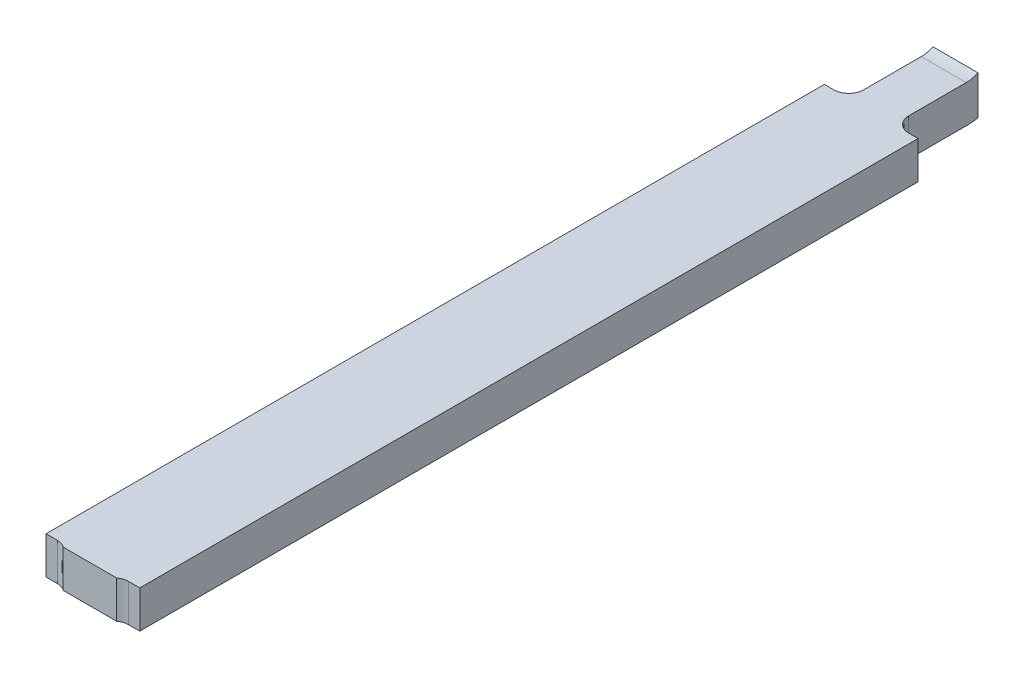
ISO-10303-21;
HEADER;
FILE_DESCRIPTION(('STEP AP214'),'2;1');
FILE_NAME('part.step','',(''),(''),'','','');
FILE_SCHEMA(('AUTOMOTIVE_DESIGN { 1 0 10303 214 1 1 1 1 }'));
ENDSEC;
DATA;
#1=APPLICATION_CONTEXT('core data for automotive mechanical design processes');
#2=APPLICATION_PROTOCOL_DEFINITION('international standard','automotive_design',2000,#1);
#3=PRODUCT_CONTEXT('',#1,'mechanical');
#4=PRODUCT('Part','Part','',(#3));
#5=PRODUCT_RELATED_PRODUCT_CATEGORY('part','',(#4));
#6=PRODUCT_DEFINITION_FORMATION('','',#4);
#7=PRODUCT_DEFINITION_CONTEXT('part definition',#1,'design');
#8=PRODUCT_DEFINITION('design','',#6,#7);
#9=PRODUCT_DEFINITION_SHAPE('','',#8);
#10=(LENGTH_UNIT() NAMED_UNIT(*) SI_UNIT(.MILLI.,.METRE.));
#11=(NAMED_UNIT(*) PLANE_ANGLE_UNIT() SI_UNIT($,.RADIAN.));
#12=(NAMED_UNIT(*) SI_UNIT($,.STERADIAN.) SOLID_ANGLE_UNIT());
#13=UNCERTAINTY_MEASURE_WITH_UNIT(LENGTH_MEASURE(1.E-05),#10,'distance_accuracy_value','');
#14=(GEOMETRIC_REPRESENTATION_CONTEXT(3) GLOBAL_UNCERTAINTY_ASSIGNED_CONTEXT((#13)) GLOBAL_UNIT_ASSIGNED_CONTEXT((#10,
#11,#12)) REPRESENTATION_CONTEXT('',''));
#15=CARTESIAN_POINT('',(0.,0.,0.));
#16=DIRECTION('',(0.,0.,1.));
#17=DIRECTION('',(1.,0.,0.));
#18=AXIS2_PLACEMENT_3D('',#15,#16,#17);
#19=CARTESIAN_POINT('',(-4.,-0.3652289464185,-7.500488855463));
#20=DIRECTION('',(0.,0.,1.));
#21=DIRECTION('',(1.,0.,0.));
#22=AXIS2_PLACEMENT_3D('',#19,#20,#21);
#23=PLANE('',#22);
#24=DIRECTION('',(0.,1.,0.));
#25=VECTOR('',#24,1.);
#26=CARTESIAN_POINT('',(-3.88,-0.3694122088881,-7.500488855463));
#27=LINE('',#26,#25);
#28=CARTESIAN_POINT('',(-3.88,-0.469296338681694,-7.50048885546298));
#29=VERTEX_POINT('',#28);
#30=CARTESIAN_POINT('',(-3.88,-0.261161554155171,-7.50048885546301));
#31=VERTEX_POINT('',#30);
#32=EDGE_CURVE('E150',#29,#31,#27,.T.);
#33=ORIENTED_EDGE('',*,*,#32,.F.);
#34=DIRECTION('',(-1.,0.,0.));
#35=VECTOR('',#34,1.);
#36=CARTESIAN_POINT('',(-3.874272716281,-0.469296338681697,-7.50048885546296));
#37=LINE('',#36,#35);
#38=CARTESIAN_POINT('',(-4.12,-0.469296338681694,-7.50048885546298));
#39=VERTEX_POINT('',#38);
#40=EDGE_CURVE('E139',#39,#29,#37,.F.);
#41=ORIENTED_EDGE('',*,*,#40,.F.);
#42=DIRECTION('',(0.,1.,0.));
#43=VECTOR('',#42,1.);
#44=CARTESIAN_POINT('',(-4.12,-0.3694122088881,-7.500488855463));
#45=LINE('',#44,#43);
#46=CARTESIAN_POINT('',(-4.12,-0.261161554155171,-7.50048885546301));
#47=VERTEX_POINT('',#46);
#48=EDGE_CURVE('E535',#39,#47,#45,.T.);
#49=ORIENTED_EDGE('',*,*,#48,.T.);
#50=DIRECTION('',(1.,0.,0.));
#51=VECTOR('',#50,1.);
#52=CARTESIAN_POINT('',(-4.125727283719,-0.261161554155164,-7.50048885546303));
#53=LINE('',#52,#51);
#54=EDGE_CURVE('E147',#47,#31,#53,.T.);
#55=ORIENTED_EDGE('',*,*,#54,.T.);
#56=EDGE_LOOP('',(#33,#41,#49,#55));
#57=FACE_BOUND('',#56,.T.);
#58=ADVANCED_FACE('F17',(#57),#23,.F.);
#59=CARTESIAN_POINT('',(-3.874272716281,-0.125,-7.43756007691));
#60=DIRECTION('',(-1.,0.,0.));
#61=DIRECTION('',(0.,0.,1.));
#62=AXIS2_PLACEMENT_3D('',#59,#60,#61);
#63=CYLINDRICAL_SURFACE('',#62,0.3499999999997);
#64=CARTESIAN_POINT('',(-4.12,-0.125,-7.43756007691));
#65=DIRECTION('',(-1.,0.,0.));
#66=DIRECTION('',(0.,0.,1.));
#67=AXIS2_PLACEMENT_3D('',#64,#65,#66);
#68=CIRCLE('',#67,0.3499999999997);
#69=CARTESIAN_POINT('',(-4.12,-0.475,-7.43756007691));
#70=VERTEX_POINT('',#69);
#71=EDGE_CURVE('E250',#70,#39,#68,.F.);
#72=ORIENTED_EDGE('',*,*,#71,.T.);
#73=ORIENTED_EDGE('',*,*,#40,.T.);
#74=CARTESIAN_POINT('',(-3.88,-0.125,-7.43756007691));
#75=DIRECTION('',(-1.,0.,0.));
#76=DIRECTION('',(0.,0.,1.));
#77=AXIS2_PLACEMENT_3D('',#74,#75,#76);
#78=CIRCLE('',#77,0.3499999999997);
#79=CARTESIAN_POINT('',(-3.88,-0.475,-7.43756007691));
#80=VERTEX_POINT('',#79);
#81=EDGE_CURVE('E274',#80,#29,#78,.F.);
#82=ORIENTED_EDGE('',*,*,#81,.F.);
#83=DIRECTION('',(1.,0.,0.));
#84=VECTOR('',#83,1.);
#85=CARTESIAN_POINT('',(-4.,-0.475,-7.43756007691));
#86=LINE('',#85,#84);
#87=EDGE_CURVE('E138',#80,#70,#86,.F.);
#88=ORIENTED_EDGE('',*,*,#87,.T.);
#89=EDGE_LOOP('',(#72,#73,#82,#88));
#90=FACE_BOUND('',#89,.T.);
#91=ADVANCED_FACE('F255',(#90),#63,.T.);
#92=CARTESIAN_POINT('',(-4.,-0.475,-5.160844573418));
#93=DIRECTION('',(0.,1.,0.));
#94=DIRECTION('',(0.,0.,1.));
#95=AXIS2_PLACEMENT_3D('',#92,#93,#94);
#96=PLANE('',#95);
#97=DIRECTION('',(1.,0.,0.));
#98=VECTOR('',#97,1.);
#99=CARTESIAN_POINT('',(-4.,-0.475,-2.9));
#100=LINE('',#99,#98);
#101=CARTESIAN_POINT('',(-4.25,-0.475,-2.9));
#102=VERTEX_POINT('',#101);
#103=CARTESIAN_POINT('',(-4.19,-0.475,-2.89999999999976));
#104=VERTEX_POINT('',#103);
#105=EDGE_CURVE('E118',#102,#104,#100,.T.);
#106=ORIENTED_EDGE('',*,*,#105,.F.);
#107=DIRECTION('',(0.,0.,-1.));
#108=VECTOR('',#107,1.);
#109=CARTESIAN_POINT('',(-4.25,-0.475,-4.975579331992));
#110=LINE('',#109,#108);
#111=CARTESIAN_POINT('',(-4.25,-0.475,-7.051158663985));
#112=VERTEX_POINT('',#111);
#113=EDGE_CURVE('E213',#102,#112,#110,.T.);
#114=ORIENTED_EDGE('',*,*,#113,.T.);
#115=DIRECTION('',(1.,0.,0.));
#116=VECTOR('',#115,1.);
#117=CARTESIAN_POINT('',(-4.225,-0.475,-7.051158663985));
#118=LINE('',#117,#116);
#119=CARTESIAN_POINT('',(-4.2,-0.475,-7.05115866398505));
#120=VERTEX_POINT('',#119);
#121=EDGE_CURVE('E218',#112,#120,#118,.T.);
#122=ORIENTED_EDGE('',*,*,#121,.T.);
#123=CARTESIAN_POINT('',(-4.11999999999968,-0.475,-7.131158663985));
#124=CARTESIAN_POINT('',(-4.12000887559487,-0.475,-7.12663228539965));
#125=CARTESIAN_POINT('',(-4.12039503047314,-0.475,-7.12211245444065));
#126=CARTESIAN_POINT('',(-4.12191562674134,-0.475,-7.11320506981295));
#127=CARTESIAN_POINT('',(-4.12304939310094,-0.475,-7.10881740054698));
#128=CARTESIAN_POINT('',(-4.12755618553401,-0.475,-7.09604021502533));
#129=CARTESIAN_POINT('',(-4.1320348186504,-0.475,-7.08801257629078));
#130=CARTESIAN_POINT('',(-4.14334118864265,-0.475,-7.07397145931293));
#131=CARTESIAN_POINT('',(-4.15014907486861,-0.475,-7.06794178198468));
#132=CARTESIAN_POINT('',(-4.16542981568031,-0.475,-7.05845747919416));
#133=CARTESIAN_POINT('',(-4.17391091624519,-0.475,-7.05501603051908));
#134=CARTESIAN_POINT('',(-4.18838450867067,-0.475,-7.05178938735803));
#135=CARTESIAN_POINT('',(-4.19419660039155,-0.475,-7.05114165155808));
#136=CARTESIAN_POINT('',(-4.2,-0.475,-7.05115866398511));
#137=B_SPLINE_CURVE_WITH_KNOTS('',3,(#123,#124,#125,#126,#127,#128,#129,#130,#131,#132,#133,
#134,#135,#136),.UNSPECIFIED.,.F.,.F.,(4,2,2,2,2,2,4),(0.,0.0135512792184595,0.0270903394942052,
0.0541002294468739,0.0808854407468732,0.107806110463938,0.125207976056708),.UNSPECIFIED.);
#138=CARTESIAN_POINT('',(-4.11999999999984,-0.475,-7.131158663985));
#139=VERTEX_POINT('',#138);
#140=EDGE_CURVE('E239',#139,#120,#137,.T.);
#141=ORIENTED_EDGE('',*,*,#140,.F.);
#142=DIRECTION('',(0.,0.,-1.));
#143=VECTOR('',#142,1.);
#144=CARTESIAN_POINT('',(-4.12,-0.475,-7.317732357319));
#145=LINE('',#144,#143);
#146=EDGE_CURVE('E537',#139,#70,#145,.T.);
#147=ORIENTED_EDGE('',*,*,#146,.T.);
#148=ORIENTED_EDGE('',*,*,#87,.F.);
#149=DIRECTION('',(0.,0.,-1.));
#150=VECTOR('',#149,1.);
#151=CARTESIAN_POINT('',(-3.88,-0.475,-7.317732357319));
#152=LINE('',#151,#150);
#153=CARTESIAN_POINT('',(-3.87999999999995,-0.475,-7.131158663985));
#154=VERTEX_POINT('',#153);
#155=EDGE_CURVE('E533',#154,#80,#152,.T.);
#156=ORIENTED_EDGE('',*,*,#155,.F.);
#157=CARTESIAN_POINT('',(-3.8,-0.475,-7.05115866398468));
#158=CARTESIAN_POINT('',(-3.80452637858535,-0.475,-7.05116753957987));
#159=CARTESIAN_POINT('',(-3.80904620954435,-0.475,-7.05155369445814));
#160=CARTESIAN_POINT('',(-3.81795359417204,-0.475,-7.05307429072634));
#161=CARTESIAN_POINT('',(-3.82234126343802,-0.475,-7.05420805708594));
#162=CARTESIAN_POINT('',(-3.83511844895965,-0.475,-7.058714849519));
#163=CARTESIAN_POINT('',(-3.8431460876942,-0.475,-7.06319348263539));
#164=CARTESIAN_POINT('',(-3.85718720467206,-0.475,-7.07449985262764));
#165=CARTESIAN_POINT('',(-3.86321688200032,-0.475,-7.0813077388536));
#166=CARTESIAN_POINT('',(-3.87270118479084,-0.475,-7.09658847966531));
#167=CARTESIAN_POINT('',(-3.87614263346592,-0.475,-7.10506958023019));
#168=CARTESIAN_POINT('',(-3.87936927662697,-0.475,-7.11954317265567));
#169=CARTESIAN_POINT('',(-3.88001701242693,-0.475,-7.12535526437655));
#170=CARTESIAN_POINT('',(-3.87999999999989,-0.475,-7.131158663985));
#171=B_SPLINE_CURVE_WITH_KNOTS('',3,(#157,#158,#159,#160,#161,#162,#163,#164,#165,#166,#167,
#168,#169,#170),.UNSPECIFIED.,.F.,.F.,(4,2,2,2,2,2,4),(0.,0.0135512792184538,0.0270903394941928,
0.0541002294468487,0.0808854407468798,0.107806110463935,0.125207976056707),.UNSPECIFIED.);
#172=CARTESIAN_POINT('',(-3.8,-0.475,-7.05115866398484));
#173=VERTEX_POINT('',#172);
#174=EDGE_CURVE('E266',#173,#154,#171,.T.);
#175=ORIENTED_EDGE('',*,*,#174,.F.);
#176=DIRECTION('',(1.,0.,0.));
#177=VECTOR('',#176,1.);
#178=CARTESIAN_POINT('',(-3.775,-0.475,-7.051158663985));
#179=LINE('',#178,#177);
#180=CARTESIAN_POINT('',(-3.75,-0.475,-7.051158663985));
#181=VERTEX_POINT('',#180);
#182=EDGE_CURVE('E151',#173,#181,#179,.T.);
#183=ORIENTED_EDGE('',*,*,#182,.T.);
#184=DIRECTION('',(0.,0.,-1.));
#185=VECTOR('',#184,1.);
#186=CARTESIAN_POINT('',(-3.75,-0.475,-4.975579331992));
#187=LINE('',#186,#185);
#188=CARTESIAN_POINT('',(-3.75,-0.475,-2.9));
#189=VERTEX_POINT('',#188);
#190=EDGE_CURVE('E155',#189,#181,#187,.T.);
#191=ORIENTED_EDGE('',*,*,#190,.F.);
#192=DIRECTION('',(1.,0.,0.));
#193=VECTOR('',#192,1.);
#194=CARTESIAN_POINT('',(-3.78,-0.475,-2.9));
#195=LINE('',#194,#193);
#196=CARTESIAN_POINT('',(-3.81,-0.475,-2.89999999999989));
#197=VERTEX_POINT('',#196);
#198=EDGE_CURVE('E163',#197,#189,#195,.T.);
#199=ORIENTED_EDGE('',*,*,#198,.F.);
#200=CARTESIAN_POINT('',(-3.85782455242115,-0.475,-2.8841290699251));
#201=CARTESIAN_POINT('',(-3.85377977929529,-0.475,-2.88715347788678));
#202=CARTESIAN_POINT('',(-3.8494455741793,-0.475,-2.88978498732686));
#203=CARTESIAN_POINT('',(-3.84086630502368,-0.475,-2.8939430866676));
#204=CARTESIAN_POINT('',(-3.83666481589101,-0.475,-2.89555994023161));
#205=CARTESIAN_POINT('',(-3.828051190578,-0.475,-2.89806057790455));
#206=CARTESIAN_POINT('',(-3.82363918895055,-0.475,-2.898944823807));
#207=CARTESIAN_POINT('',(-3.81613636516881,-0.475,-2.89981357444961));
#208=CARTESIAN_POINT('',(-3.81306715843202,-0.475,-2.89999375978714));
#209=CARTESIAN_POINT('',(-3.81,-0.475,-2.89999999999978));
#210=B_SPLINE_CURVE_WITH_KNOTS('',3,(#200,#201,#202,#203,#204,#205,#206,#207,#208,#209),
.UNSPECIFIED.,.F.,.F.,(4,2,2,2,4),(0.,0.0151223248428406,0.0285648972663139,0.0419989898086887,
0.0512012871013954),.UNSPECIFIED.);
#211=CARTESIAN_POINT('',(-3.85782455242108,-0.475,-2.88412906992505));
#212=VERTEX_POINT('',#211);
#213=EDGE_CURVE('E125',#212,#197,#210,.T.);
#214=ORIENTED_EDGE('',*,*,#213,.F.);
#215=DIRECTION('',(1.,0.,0.));
#216=VECTOR('',#215,1.);
#217=CARTESIAN_POINT('',(-4.,-0.475,-2.884129069925));
#218=LINE('',#217,#216);
#219=CARTESIAN_POINT('',(-4.14217543362795,-0.475,-2.88412906992502));
#220=VERTEX_POINT('',#219);
#221=EDGE_CURVE('E129',#220,#212,#218,.T.);
#222=ORIENTED_EDGE('',*,*,#221,.F.);
#223=CARTESIAN_POINT('',(-4.19,-0.475,-2.89999999999952));
#224=CARTESIAN_POINT('',(-4.18496730361836,-0.475,-2.90001482409384));
#225=CARTESIAN_POINT('',(-4.17991815783308,-0.475,-2.89952557596737));
#226=CARTESIAN_POINT('',(-4.16614771604895,-0.475,-2.89686256447201));
#227=CARTESIAN_POINT('',(-4.15760052391878,-0.475,-2.89367998586962));
#228=CARTESIAN_POINT('',(-4.14719213429875,-0.475,-2.88765952253235));
#229=CARTESIAN_POINT('',(-4.14462559871614,-0.475,-2.88596721904186));
#230=CARTESIAN_POINT('',(-4.1421754336279,-0.475,-2.88412906992503));
#231=B_SPLINE_CURVE_WITH_KNOTS('',3,(#223,#224,#225,#226,#227,#228,#229,#230),.UNSPECIFIED.,.F.,
.F.,(4,2,2,4),(0.,0.0151178951010511,0.0419060489798834,0.05110634020207),.UNSPECIFIED.);
#232=EDGE_CURVE('E20',#104,#220,#231,.T.);
#233=ORIENTED_EDGE('',*,*,#232,.F.);
#234=EDGE_LOOP('',(#106,#114,#122,#141,#147,#148,#156,#175,#183,#191,#199,#214,#222,#233));
#235=FACE_BOUND('',#234,.T.);
#236=ADVANCED_FACE('F135',(#235),#96,.F.);
#237=CARTESIAN_POINT('',(-3.807132391521,-0.269272716281,-2.899957930186));
#238=CARTESIAN_POINT('',(-3.808087324483,-0.269272716281,-2.899988554812));
#239=CARTESIAN_POINT('',(-3.814268512342,-0.269272716281,-2.900079343105));
#240=CARTESIAN_POINT('',(-3.825708586311,-0.269272716281,-2.898963559635));
#241=CARTESIAN_POINT('',(-3.840809082916,-0.269272716281,-2.894390814224));
#242=CARTESIAN_POINT('',(-3.8513126737,-0.269272716281,-2.888776760997));
#243=CARTESIAN_POINT('',(-3.858278976833,-0.269272716281,-2.883851645707));
#244=CARTESIAN_POINT('',(-3.860847948139,-0.269272716281,-2.881786274905));
#245=CARTESIAN_POINT('',(-3.862294521887,-0.269272716281,-2.880535760884));
#246=(BOUNDED_CURVE() B_SPLINE_CURVE(3,(#237,#238,#239,#240,#241,#242,#243,#244,#245),
.UNSPECIFIED.,.F.,.F.) B_SPLINE_CURVE_WITH_KNOTS((4,1,1,1,1,1,4),(0.,0.0480076126077,
0.3103664664067,0.5726487803877,0.8349383013297,0.9041878403074,1.),
.UNSPECIFIED.) CURVE() GEOMETRIC_REPRESENTATION_ITEM() RATIONAL_B_SPLINE_CURVE((1.,1.,1.,1.,1.,
1.,1.,1.,1.)) REPRESENTATION_ITEM(''));
#247=DIRECTION('',(0.,-1.,0.));
#248=VECTOR('',#247,1.);
#249=SURFACE_OF_LINEAR_EXTRUSION('',#246,#248);
#250=CARTESIAN_POINT('',(-3.85782455535254,-0.275,-2.88412906773656));
#251=CARTESIAN_POINT('',(-3.85377978236567,-0.275,-2.88715347588347));
#252=CARTESIAN_POINT('',(-3.84944557737024,-0.275,-2.88978498552233));
#253=CARTESIAN_POINT('',(-3.84086630840598,-0.275,-2.89394308525624));
#254=CARTESIAN_POINT('',(-3.83666481934832,-0.275,-2.89555993901277));
#255=CARTESIAN_POINT('',(-3.82805119415026,-0.275,-2.89806057708111));
#256=CARTESIAN_POINT('',(-3.82363919256267,-0.275,-2.89894482318606));
#257=CARTESIAN_POINT('',(-3.81613636760673,-0.275,-2.89981357430863));
#258=CARTESIAN_POINT('',(-3.81306715965084,-0.275,-2.89999375978684));
#259=CARTESIAN_POINT('',(-3.81,-0.275,-2.89999999999978));
#260=B_SPLINE_CURVE_WITH_KNOTS('',3,(#250,#251,#252,#253,#254,#255,#256,#257,#258,#259),
.UNSPECIFIED.,.F.,.F.,(4,2,2,2,4),(0.,0.0151223248426714,0.0285648972632457,0.0419989898096649,
0.0512012907536535),.UNSPECIFIED.);
#261=CARTESIAN_POINT('',(-3.85782455388677,-0.275,-2.88412906883078));
#262=VERTEX_POINT('',#261);
#263=CARTESIAN_POINT('',(-3.81,-0.275,-2.9));
#264=VERTEX_POINT('',#263);
#265=EDGE_CURVE('E132',#262,#264,#260,.T.);
#266=ORIENTED_EDGE('',*,*,#265,.F.);
#267=DIRECTION('',(0.,1.,0.));
#268=VECTOR('',#267,1.);
#269=CARTESIAN_POINT('',(-3.857824552421,-0.375,-2.884129069925));
#270=LINE('',#269,#268);
#271=EDGE_CURVE('E133',#212,#262,#270,.T.);
#272=ORIENTED_EDGE('',*,*,#271,.F.);
#273=ORIENTED_EDGE('',*,*,#213,.T.);
#274=DIRECTION('',(0.,1.,0.));
#275=VECTOR('',#274,1.);
#276=CARTESIAN_POINT('',(-3.81,-0.375,-2.9));
#277=LINE('',#276,#275);
#278=EDGE_CURVE('E166',#264,#197,#277,.F.);
#279=ORIENTED_EDGE('',*,*,#278,.F.);
#280=EDGE_LOOP('',(#266,#272,#273,#279));
#281=FACE_BOUND('',#280,.T.);
#282=ADVANCED_FACE('F254',(#281),#249,.T.);
#283=CARTESIAN_POINT('',(-3.78,-0.375,-2.9));
#284=DIRECTION('',(0.,0.,1.));
#285=DIRECTION('',(1.,0.,0.));
#286=AXIS2_PLACEMENT_3D('',#283,#284,#285);
#287=PLANE('',#286);
#288=DIRECTION('',(0.,1.,0.));
#289=VECTOR('',#288,1.);
#290=CARTESIAN_POINT('',(-3.75,-0.375,-2.9));
#291=LINE('',#290,#289);
#292=CARTESIAN_POINT('',(-3.75,-0.275,-2.9));
#293=VERTEX_POINT('',#292);
#294=EDGE_CURVE('E160',#293,#189,#291,.F.);
#295=ORIENTED_EDGE('',*,*,#294,.F.);
#296=DIRECTION('',(1.,0.,0.));
#297=VECTOR('',#296,1.);
#298=CARTESIAN_POINT('',(-4.,-0.275,-2.9));
#299=LINE('',#298,#297);
#300=EDGE_CURVE('E306',#264,#293,#299,.T.);
#301=ORIENTED_EDGE('',*,*,#300,.F.);
#302=ORIENTED_EDGE('',*,*,#278,.T.);
#303=ORIENTED_EDGE('',*,*,#198,.T.);
#304=EDGE_LOOP('',(#295,#301,#302,#303));
#305=FACE_BOUND('',#304,.T.);
#306=ADVANCED_FACE('F368',(#305),#287,.T.);
#307=CARTESIAN_POINT('',(-3.75,-0.375,-4.975579331992));
#308=DIRECTION('',(1.,0.,0.));
#309=DIRECTION('',(0.,0.,-1.));
#310=AXIS2_PLACEMENT_3D('',#307,#308,#309);
#311=PLANE('',#310);
#312=DIRECTION('',(0.,1.,0.));
#313=VECTOR('',#312,1.);
#314=CARTESIAN_POINT('',(-3.75,-0.375,-7.051158663985));
#315=LINE('',#314,#313);
#316=CARTESIAN_POINT('',(-3.75,-0.275,-7.051158663985));
#317=VERTEX_POINT('',#316);
#318=EDGE_CURVE('E154',#181,#317,#315,.T.);
#319=ORIENTED_EDGE('',*,*,#318,.T.);
#320=DIRECTION('',(0.,0.,1.));
#321=VECTOR('',#320,1.);
#322=CARTESIAN_POINT('',(-3.75,-0.275,-5.160844573418));
#323=LINE('',#322,#321);
#324=EDGE_CURVE('E302',#293,#317,#323,.F.);
#325=ORIENTED_EDGE('',*,*,#324,.F.);
#326=ORIENTED_EDGE('',*,*,#294,.T.);
#327=ORIENTED_EDGE('',*,*,#190,.T.);
#328=EDGE_LOOP('',(#319,#325,#326,#327));
#329=FACE_BOUND('',#328,.T.);
#330=ADVANCED_FACE('F373',(#329),#311,.T.);
#331=CARTESIAN_POINT('',(-3.775,-0.375,-7.051158663985));
#332=DIRECTION('',(0.,0.,1.));
#333=DIRECTION('',(1.,0.,0.));
#334=AXIS2_PLACEMENT_3D('',#331,#332,#333);
#335=PLANE('',#334);
#336=ORIENTED_EDGE('',*,*,#182,.F.);
#337=DIRECTION('',(0.,-1.,0.));
#338=VECTOR('',#337,1.);
#339=CARTESIAN_POINT('',(-3.8,-0.269272716281,-7.05115866398468));
#340=LINE('',#339,#338);
#341=CARTESIAN_POINT('',(-3.8,-0.275,-7.05115866398476));
#342=VERTEX_POINT('',#341);
#343=EDGE_CURVE('E273',#342,#173,#340,.T.);
#344=ORIENTED_EDGE('',*,*,#343,.F.);
#345=DIRECTION('',(1.,0.,0.));
#346=VECTOR('',#345,1.);
#347=CARTESIAN_POINT('',(-4.,-0.275,-7.051158663985));
#348=LINE('',#347,#346);
#349=EDGE_CURVE('E305',#317,#342,#348,.F.);
#350=ORIENTED_EDGE('',*,*,#349,.F.);
#351=ORIENTED_EDGE('',*,*,#318,.F.);
#352=EDGE_LOOP('',(#336,#344,#350,#351));
#353=FACE_BOUND('',#352,.T.);
#354=ADVANCED_FACE('F283',(#353),#335,.F.);
#355=CARTESIAN_POINT('',(-3.879957929587,-0.269272716281,-7.134026291144));
#356=CARTESIAN_POINT('',(-3.879988554629,-0.269272716281,-7.133071351971));
#357=CARTESIAN_POINT('',(-3.880079343715,-0.269272716281,-7.126890157897));
#358=CARTESIAN_POINT('',(-3.878963559635,-0.269272716281,-7.115450077674));
#359=CARTESIAN_POINT('',(-3.874390814224,-0.269272716281,-7.100349581069));
#360=CARTESIAN_POINT('',(-3.866951052025,-0.269272716281,-7.086430187272));
#361=CARTESIAN_POINT('',(-3.856931304376,-0.269272716281,-7.074236320435));
#362=CARTESIAN_POINT('',(-3.844737903504,-0.269272716281,-7.064213675467));
#363=CARTESIAN_POINT('',(-3.830816201624,-0.269272716281,-7.056770327068));
#364=CARTESIAN_POINT('',(-3.815712040492,-0.269272716281,-7.05219575577));
#365=CARTESIAN_POINT('',(-3.804270485404,-0.269272716281,-7.051079350384));
#366=CARTESIAN_POINT('',(-3.798089320739,-0.269272716281,-7.051170096432));
#367=CARTESIAN_POINT('',(-3.797135381259,-0.269272716281,-7.0512006723));
#368=(BOUNDED_CURVE() B_SPLINE_CURVE(3,(#355,#356,#357,#358,#359,#360,#361,#362,#363,#364,#365,
#366,#367),.UNSPECIFIED.,.F.,.F.) B_SPLINE_CURVE_WITH_KNOTS((4,1,1,1,1,1,1,1,1,1,4),(0.,
0.02187366901521,0.1414112381412,0.260913933719,0.380419912977,0.4999590271853,0.6195124003892,
0.7390518477007,0.8585895788734,0.9781493142558,1.),
.UNSPECIFIED.) CURVE() GEOMETRIC_REPRESENTATION_ITEM() RATIONAL_B_SPLINE_CURVE((1.,1.,1.,1.,1.,
1.,1.,1.,1.,1.,1.,1.,1.)) REPRESENTATION_ITEM(''));
#369=DIRECTION('',(0.,-1.,0.));
#370=VECTOR('',#369,1.);
#371=SURFACE_OF_LINEAR_EXTRUSION('',#368,#370);
#372=DIRECTION('',(0.,1.,0.));
#373=VECTOR('',#372,1.);
#374=CARTESIAN_POINT('',(-3.88,-0.3694122088881,-7.131158663985));
#375=LINE('',#374,#373);
#376=CARTESIAN_POINT('',(-3.88,-0.275,-7.131158663985));
#377=VERTEX_POINT('',#376);
#378=EDGE_CURVE('E272',#377,#154,#375,.F.);
#379=ORIENTED_EDGE('',*,*,#378,.F.);
#380=CARTESIAN_POINT('',(-3.8,-0.275,-7.05115866398468));
#381=CARTESIAN_POINT('',(-3.80452637858535,-0.275,-7.05116753957987));
#382=CARTESIAN_POINT('',(-3.80904620954435,-0.275,-7.05155369445814));
#383=CARTESIAN_POINT('',(-3.81795359417204,-0.275,-7.05307429072634));
#384=CARTESIAN_POINT('',(-3.82234126343802,-0.275,-7.05420805708594));
#385=CARTESIAN_POINT('',(-3.83511844895965,-0.275,-7.058714849519));
#386=CARTESIAN_POINT('',(-3.8431460876942,-0.275,-7.06319348263539));
#387=CARTESIAN_POINT('',(-3.85718720467206,-0.275,-7.07449985262764));
#388=CARTESIAN_POINT('',(-3.86321688200032,-0.275,-7.0813077388536));
#389=CARTESIAN_POINT('',(-3.87270118479084,-0.275,-7.09658847966531));
#390=CARTESIAN_POINT('',(-3.87614263346592,-0.275,-7.10506958023019));
#391=CARTESIAN_POINT('',(-3.87936927662697,-0.275,-7.11954317265567));
#392=CARTESIAN_POINT('',(-3.88001701242693,-0.275,-7.12535526437655));
#393=CARTESIAN_POINT('',(-3.87999999999989,-0.275,-7.131158663985));
#394=B_SPLINE_CURVE_WITH_KNOTS('',3,(#380,#381,#382,#383,#384,#385,#386,#387,#388,#389,#390,
#391,#392,#393),.UNSPECIFIED.,.F.,.F.,(4,2,2,2,2,2,4),(0.,0.0135512792184538,0.0270903394941928,
0.0541002294468487,0.0808854407468798,0.107806110463935,0.125207976056707),.UNSPECIFIED.);
#395=EDGE_CURVE('E355',#342,#377,#394,.T.);
#396=ORIENTED_EDGE('',*,*,#395,.F.);
#397=ORIENTED_EDGE('',*,*,#343,.T.);
#398=ORIENTED_EDGE('',*,*,#174,.T.);
#399=EDGE_LOOP('',(#379,#396,#397,#398));
#400=FACE_BOUND('',#399,.T.);
#401=ADVANCED_FACE('F276',(#400),#371,.T.);
#402=CARTESIAN_POINT('',(-3.88,-0.3694122088881,-7.317732357319));
#403=DIRECTION('',(1.,0.,0.));
#404=DIRECTION('',(0.,0.,-1.));
#405=AXIS2_PLACEMENT_3D('',#402,#403,#404);
#406=PLANE('',#405);
#407=ORIENTED_EDGE('',*,*,#81,.T.);
#408=ORIENTED_EDGE('',*,*,#32,.T.);
#409=CARTESIAN_POINT('',(-3.88,-0.125,-7.437560076911));
#410=DIRECTION('',(1.,0.,0.));
#411=DIRECTION('',(0.,0.,-1.));
#412=AXIS2_PLACEMENT_3D('',#409,#410,#411);
#413=CIRCLE('',#412,0.15);
#414=CARTESIAN_POINT('',(-3.88,-0.275,-7.437560076911));
#415=VERTEX_POINT('',#414);
#416=EDGE_CURVE('E149',#31,#415,#413,.F.);
#417=ORIENTED_EDGE('',*,*,#416,.T.);
#418=DIRECTION('',(0.,0.,1.));
#419=VECTOR('',#418,1.);
#420=CARTESIAN_POINT('',(-3.88,-0.275,-5.160844573418));
#421=LINE('',#420,#419);
#422=EDGE_CURVE('E348',#377,#415,#421,.F.);
#423=ORIENTED_EDGE('',*,*,#422,.F.);
#424=ORIENTED_EDGE('',*,*,#378,.T.);
#425=ORIENTED_EDGE('',*,*,#155,.T.);
#426=EDGE_LOOP('',(#407,#408,#417,#423,#424,#425));
#427=FACE_BOUND('',#426,.T.);
#428=ADVANCED_FACE('F282',(#427),#406,.T.);
#429=CARTESIAN_POINT('',(-4.125727283719,-0.125,-7.437560076911));
#430=DIRECTION('',(1.,0.,0.));
#431=DIRECTION('',(0.,0.,-1.));
#432=AXIS2_PLACEMENT_3D('',#429,#430,#431);
#433=CYLINDRICAL_SURFACE('',#432,0.15);
#434=DIRECTION('',(1.,0.,0.));
#435=VECTOR('',#434,1.);
#436=CARTESIAN_POINT('',(-4.,-0.275,-7.437560076911));
#437=LINE('',#436,#435);
#438=CARTESIAN_POINT('',(-4.12,-0.275,-7.437560076911));
#439=VERTEX_POINT('',#438);
#440=EDGE_CURVE('E346',#415,#439,#437,.F.);
#441=ORIENTED_EDGE('',*,*,#440,.F.);
#442=ORIENTED_EDGE('',*,*,#416,.F.);
#443=ORIENTED_EDGE('',*,*,#54,.F.);
#444=CARTESIAN_POINT('',(-4.12,-0.125,-7.437560076911));
#445=DIRECTION('',(1.,0.,0.));
#446=DIRECTION('',(0.,0.,-1.));
#447=AXIS2_PLACEMENT_3D('',#444,#445,#446);
#448=CIRCLE('',#447,0.15);
#449=EDGE_CURVE('E536',#47,#439,#448,.F.);
#450=ORIENTED_EDGE('',*,*,#449,.T.);
#451=EDGE_LOOP('',(#441,#442,#443,#450));
#452=FACE_BOUND('',#451,.T.);
#453=ADVANCED_FACE('F443',(#452),#433,.F.);
#454=CARTESIAN_POINT('',(-4.12,-0.3694122088881,-7.317732357319));
#455=DIRECTION('',(1.,0.,0.));
#456=DIRECTION('',(0.,0.,-1.));
#457=AXIS2_PLACEMENT_3D('',#454,#455,#456);
#458=PLANE('',#457);
#459=ORIENTED_EDGE('',*,*,#146,.F.);
#460=DIRECTION('',(0.,-1.,0.));
#461=VECTOR('',#460,1.);
#462=CARTESIAN_POINT('',(-4.11999999999968,-0.269272716281,-7.131158663985));
#463=LINE('',#462,#461);
#464=CARTESIAN_POINT('',(-4.11999999999976,-0.275,-7.131158663985));
#465=VERTEX_POINT('',#464);
#466=EDGE_CURVE('E223',#465,#139,#463,.T.);
#467=ORIENTED_EDGE('',*,*,#466,.F.);
#468=DIRECTION('',(0.,0.,1.));
#469=VECTOR('',#468,1.);
#470=CARTESIAN_POINT('',(-4.12,-0.275,-5.160844573418));
#471=LINE('',#470,#469);
#472=EDGE_CURVE('E345',#439,#465,#471,.T.);
#473=ORIENTED_EDGE('',*,*,#472,.F.);
#474=ORIENTED_EDGE('',*,*,#449,.F.);
#475=ORIENTED_EDGE('',*,*,#48,.F.);
#476=ORIENTED_EDGE('',*,*,#71,.F.);
#477=EDGE_LOOP('',(#459,#467,#473,#474,#475,#476));
#478=FACE_BOUND('',#477,.T.);
#479=ADVANCED_FACE('F234',(#478),#458,.F.);
#480=CARTESIAN_POINT('',(-4.202867627159,-0.269272716281,-7.051200734398));
#481=CARTESIAN_POINT('',(-4.201912687986,-0.269272716281,-7.051170109356));
#482=CARTESIAN_POINT('',(-4.195731493912,-0.269272716281,-7.05107932027));
#483=CARTESIAN_POINT('',(-4.184291413689,-0.269272716281,-7.05219510435));
#484=CARTESIAN_POINT('',(-4.169190917084,-0.269272716281,-7.056767849761));
#485=CARTESIAN_POINT('',(-4.155271523287,-0.269272716281,-7.06420761196));
#486=CARTESIAN_POINT('',(-4.14307765645,-0.269272716281,-7.074227359609));
#487=CARTESIAN_POINT('',(-4.133055011482,-0.269272716281,-7.086420760481));
#488=CARTESIAN_POINT('',(-4.125611663083,-0.269272716281,-7.100342462361));
#489=CARTESIAN_POINT('',(-4.121037091785,-0.269272716281,-7.115446623493));
#490=CARTESIAN_POINT('',(-4.119920686399,-0.269272716281,-7.126888178581));
#491=CARTESIAN_POINT('',(-4.120011432447,-0.269272716281,-7.133069343246));
#492=CARTESIAN_POINT('',(-4.120042008315,-0.269272716281,-7.134023282726));
#493=(BOUNDED_CURVE() B_SPLINE_CURVE(3,(#480,#481,#482,#483,#484,#485,#486,#487,#488,#489,#490,
#491,#492),.UNSPECIFIED.,.F.,.F.) B_SPLINE_CURVE_WITH_KNOTS((4,1,1,1,1,1,1,1,1,1,4),(0.,
0.02187366901522,0.1414112381412,0.260913933719,0.380419912977,0.4999590271853,0.6195124003892,
0.7390518477007,0.8585895788734,0.9781493142558,1.),
.UNSPECIFIED.) CURVE() GEOMETRIC_REPRESENTATION_ITEM() RATIONAL_B_SPLINE_CURVE((1.,1.,1.,1.,1.,
1.,1.,1.,1.,1.,1.,1.,1.)) REPRESENTATION_ITEM(''));
#494=DIRECTION('',(0.,-1.,0.));
#495=VECTOR('',#494,1.);
#496=SURFACE_OF_LINEAR_EXTRUSION('',#493,#495);
#497=DIRECTION('',(0.,1.,0.));
#498=VECTOR('',#497,1.);
#499=CARTESIAN_POINT('',(-4.2,-0.375,-7.051158663985));
#500=LINE('',#499,#498);
#501=CARTESIAN_POINT('',(-4.2,-0.275,-7.051158663985));
#502=VERTEX_POINT('',#501);
#503=EDGE_CURVE('E216',#120,#502,#500,.T.);
#504=ORIENTED_EDGE('',*,*,#503,.T.);
#505=CARTESIAN_POINT('',(-4.11999999999968,-0.275,-7.131158663985));
#506=CARTESIAN_POINT('',(-4.12000887559487,-0.275,-7.12663228539965));
#507=CARTESIAN_POINT('',(-4.12039503047314,-0.275,-7.12211245444065));
#508=CARTESIAN_POINT('',(-4.12191562674134,-0.275,-7.11320506981295));
#509=CARTESIAN_POINT('',(-4.12304939310094,-0.275,-7.10881740054698));
#510=CARTESIAN_POINT('',(-4.12755618553401,-0.275,-7.09604021502533));
#511=CARTESIAN_POINT('',(-4.1320348186504,-0.275,-7.08801257629078));
#512=CARTESIAN_POINT('',(-4.14334118864265,-0.275,-7.07397145931293));
#513=CARTESIAN_POINT('',(-4.15014907486861,-0.275,-7.06794178198468));
#514=CARTESIAN_POINT('',(-4.16542981568031,-0.275,-7.05845747919416));
#515=CARTESIAN_POINT('',(-4.17391091624519,-0.275,-7.05501603051908));
#516=CARTESIAN_POINT('',(-4.18838450867067,-0.275,-7.05178938735803));
#517=CARTESIAN_POINT('',(-4.19419660039155,-0.275,-7.05114165155808));
#518=CARTESIAN_POINT('',(-4.2,-0.275,-7.05115866398511));
#519=B_SPLINE_CURVE_WITH_KNOTS('',3,(#505,#506,#507,#508,#509,#510,#511,#512,#513,#514,#515,
#516,#517,#518),.UNSPECIFIED.,.F.,.F.,(4,2,2,2,2,2,4),(0.,0.0135512792184595,0.0270903394942052,
0.0541002294468739,0.0808854407468732,0.107806110463938,0.125207976056707),.UNSPECIFIED.);
#520=EDGE_CURVE('E175',#465,#502,#519,.T.);
#521=ORIENTED_EDGE('',*,*,#520,.F.);
#522=ORIENTED_EDGE('',*,*,#466,.T.);
#523=ORIENTED_EDGE('',*,*,#140,.T.);
#524=EDGE_LOOP('',(#504,#521,#522,#523));
#525=FACE_BOUND('',#524,.T.);
#526=ADVANCED_FACE('F228',(#525),#496,.T.);
#527=CARTESIAN_POINT('',(-4.225,-0.375,-7.051158663985));
#528=DIRECTION('',(0.,0.,1.));
#529=DIRECTION('',(1.,0.,0.));
#530=AXIS2_PLACEMENT_3D('',#527,#528,#529);
#531=PLANE('',#530);
#532=ORIENTED_EDGE('',*,*,#121,.F.);
#533=DIRECTION('',(0.,1.,0.));
#534=VECTOR('',#533,1.);
#535=CARTESIAN_POINT('',(-4.25,-0.375,-7.051158663985));
#536=LINE('',#535,#534);
#537=CARTESIAN_POINT('',(-4.25,-0.275,-7.051158663985));
#538=VERTEX_POINT('',#537);
#539=EDGE_CURVE('E202',#112,#538,#536,.T.);
#540=ORIENTED_EDGE('',*,*,#539,.T.);
#541=DIRECTION('',(1.,0.,0.));
#542=VECTOR('',#541,1.);
#543=CARTESIAN_POINT('',(-4.,-0.275,-7.051158663985));
#544=LINE('',#543,#542);
#545=EDGE_CURVE('E208',#502,#538,#544,.F.);
#546=ORIENTED_EDGE('',*,*,#545,.F.);
#547=ORIENTED_EDGE('',*,*,#503,.F.);
#548=EDGE_LOOP('',(#532,#540,#546,#547));
#549=FACE_BOUND('',#548,.T.);
#550=ADVANCED_FACE('F233',(#549),#531,.F.);
#551=CARTESIAN_POINT('',(-4.25,-0.375,-4.975579331992));
#552=DIRECTION('',(1.,0.,0.));
#553=DIRECTION('',(0.,0.,-1.));
#554=AXIS2_PLACEMENT_3D('',#551,#552,#553);
#555=PLANE('',#554);
#556=ORIENTED_EDGE('',*,*,#113,.F.);
#557=DIRECTION('',(0.,1.,0.));
#558=VECTOR('',#557,1.);
#559=CARTESIAN_POINT('',(-4.25,-0.375,-2.9));
#560=LINE('',#559,#558);
#561=CARTESIAN_POINT('',(-4.25,-0.275,-2.9));
#562=VERTEX_POINT('',#561);
#563=EDGE_CURVE('E200',#562,#102,#560,.F.);
#564=ORIENTED_EDGE('',*,*,#563,.F.);
#565=DIRECTION('',(0.,0.,1.));
#566=VECTOR('',#565,1.);
#567=CARTESIAN_POINT('',(-4.25,-0.275,-5.160844573418));
#568=LINE('',#567,#566);
#569=EDGE_CURVE('E205',#538,#562,#568,.T.);
#570=ORIENTED_EDGE('',*,*,#569,.F.);
#571=ORIENTED_EDGE('',*,*,#539,.F.);
#572=EDGE_LOOP('',(#556,#564,#570,#571));
#573=FACE_BOUND('',#572,.T.);
#574=ADVANCED_FACE('F384',(#573),#555,.F.);
#575=CARTESIAN_POINT('',(-4.22,-0.375,-2.9));
#576=DIRECTION('',(0.,0.,1.));
#577=DIRECTION('',(1.,0.,0.));
#578=AXIS2_PLACEMENT_3D('',#575,#576,#577);
#579=PLANE('',#578);
#580=DIRECTION('',(0.,-1.,0.));
#581=VECTOR('',#580,1.);
#582=CARTESIAN_POINT('',(-4.19,-0.269272716281,-2.89999999999952));
#583=LINE('',#582,#581);
#584=CARTESIAN_POINT('',(-4.19,-0.275,-2.89999999999964));
#585=VERTEX_POINT('',#584);
#586=EDGE_CURVE('E122',#585,#104,#583,.T.);
#587=ORIENTED_EDGE('',*,*,#586,.F.);
#588=DIRECTION('',(1.,0.,0.));
#589=VECTOR('',#588,1.);
#590=CARTESIAN_POINT('',(-4.,-0.275,-2.9));
#591=LINE('',#590,#589);
#592=EDGE_CURVE('E174',#562,#585,#591,.T.);
#593=ORIENTED_EDGE('',*,*,#592,.F.);
#594=ORIENTED_EDGE('',*,*,#563,.T.);
#595=ORIENTED_EDGE('',*,*,#105,.T.);
#596=EDGE_LOOP('',(#587,#593,#594,#595));
#597=FACE_BOUND('',#596,.T.);
#598=ADVANCED_FACE('F188',(#597),#579,.T.);
#599=CARTESIAN_POINT('',(-4.137705468181,-0.269272716281,-2.880535754175));
#600=CARTESIAN_POINT('',(-4.139152040785,-0.269272716281,-2.881786269205));
#601=CARTESIAN_POINT('',(-4.141717902577,-0.269272716281,-2.88384914542));
#602=CARTESIAN_POINT('',(-4.148681761871,-0.269272716281,-2.888773339751));
#603=CARTESIAN_POINT('',(-4.159183798376,-0.269272716281,-2.894388336917));
#604=CARTESIAN_POINT('',(-4.174287959508,-0.269272716281,-2.898962908215));
#605=CARTESIAN_POINT('',(-4.185729509199,-0.269272716281,-2.900079313074));
#606=CARTESIAN_POINT('',(-4.191910668499,-0.269272716281,-2.89998856771));
#607=CARTESIAN_POINT('',(-4.192864602618,-0.269272716281,-2.899957992201));
#608=(BOUNDED_CURVE() B_SPLINE_CURVE(3,(#599,#600,#601,#602,#603,#604,#605,#606,#607),
.UNSPECIFIED.,.F.,.F.) B_SPLINE_CURVE_WITH_KNOTS((4,1,1,1,1,1,4),(0.,0.09581704921695,
0.1648704820857,0.4272468470588,0.6896194452896,0.952040340422,1.),
.UNSPECIFIED.) CURVE() GEOMETRIC_REPRESENTATION_ITEM() RATIONAL_B_SPLINE_CURVE((1.,1.,1.,1.,1.,
1.,1.,1.,1.)) REPRESENTATION_ITEM(''));
#609=DIRECTION('',(0.,-1.,0.));
#610=VECTOR('',#609,1.);
#611=SURFACE_OF_LINEAR_EXTRUSION('',#608,#610);
#612=ORIENTED_EDGE('',*,*,#232,.T.);
#613=DIRECTION('',(0.,1.,0.));
#614=VECTOR('',#613,1.);
#615=CARTESIAN_POINT('',(-4.142175433628,-0.375,-2.884129069925));
#616=LINE('',#615,#614);
#617=CARTESIAN_POINT('',(-4.142175433628,-0.275,-2.884129069925));
#618=VERTEX_POINT('',#617);
#619=EDGE_CURVE('E40',#618,#220,#616,.F.);
#620=ORIENTED_EDGE('',*,*,#619,.F.);
#621=CARTESIAN_POINT('',(-4.19,-0.275,-2.89999999999952));
#622=CARTESIAN_POINT('',(-4.18496730361582,-0.275,-2.90001482409393));
#623=CARTESIAN_POINT('',(-4.17991815783145,-0.275,-2.89952557596743));
#624=CARTESIAN_POINT('',(-4.16614771605183,-0.275,-2.89686256447191));
#625=CARTESIAN_POINT('',(-4.15760052392676,-0.275,-2.89367998586935));
#626=CARTESIAN_POINT('',(-4.14719213324629,-0.275,-2.88765952192526));
#627=CARTESIAN_POINT('',(-4.14462559668408,-0.275,-2.88596721770684));
#628=CARTESIAN_POINT('',(-4.1421754307146,-0.275,-2.88412906774999));
#629=B_SPLINE_CURVE_WITH_KNOTS('',3,(#621,#622,#623,#624,#625,#626,#627,#628),.UNSPECIFIED.,.F.,
.F.,(4,2,2,4),(0.,0.015117895101052,0.0419060489798579,0.0511063438316887),.UNSPECIFIED.);
#630=EDGE_CURVE('E31',#585,#618,#629,.T.);
#631=ORIENTED_EDGE('',*,*,#630,.F.);
#632=ORIENTED_EDGE('',*,*,#586,.T.);
#633=EDGE_LOOP('',(#612,#620,#631,#632));
#634=FACE_BOUND('',#633,.T.);
#635=ADVANCED_FACE('F121',(#634),#611,.T.);
#636=CARTESIAN_POINT('',(-3.999999993024,-0.375,-2.884129069925));
#637=DIRECTION('',(0.,0.,1.));
#638=DIRECTION('',(1.,0.,0.));
#639=AXIS2_PLACEMENT_3D('',#636,#637,#638);
#640=PLANE('',#639);
#641=ORIENTED_EDGE('',*,*,#619,.T.);
#642=ORIENTED_EDGE('',*,*,#221,.T.);
#643=ORIENTED_EDGE('',*,*,#271,.T.);
#644=DIRECTION('',(1.,0.,0.));
#645=VECTOR('',#644,1.);
#646=CARTESIAN_POINT('',(-4.,-0.275,-2.884129069925));
#647=LINE('',#646,#645);
#648=EDGE_CURVE('E11',#618,#262,#647,.T.);
#649=ORIENTED_EDGE('',*,*,#648,.F.);
#650=EDGE_LOOP('',(#641,#642,#643,#649));
#651=FACE_BOUND('',#650,.T.);
#652=ADVANCED_FACE('F127',(#651),#640,.T.);
#653=CARTESIAN_POINT('',(-4.,-0.275,-5.160844573418));
#654=DIRECTION('',(0.,1.,0.));
#655=DIRECTION('',(0.,0.,1.));
#656=AXIS2_PLACEMENT_3D('',#653,#654,#655);
#657=PLANE('',#656);
#658=ORIENTED_EDGE('',*,*,#630,.T.);
#659=ORIENTED_EDGE('',*,*,#648,.T.);
#660=ORIENTED_EDGE('',*,*,#265,.T.);
#661=ORIENTED_EDGE('',*,*,#300,.T.);
#662=ORIENTED_EDGE('',*,*,#324,.T.);
#663=ORIENTED_EDGE('',*,*,#349,.T.);
#664=ORIENTED_EDGE('',*,*,#395,.T.);
#665=ORIENTED_EDGE('',*,*,#422,.T.);
#666=ORIENTED_EDGE('',*,*,#440,.T.);
#667=ORIENTED_EDGE('',*,*,#472,.T.);
#668=ORIENTED_EDGE('',*,*,#520,.T.);
#669=ORIENTED_EDGE('',*,*,#545,.T.);
#670=ORIENTED_EDGE('',*,*,#569,.T.);
#671=ORIENTED_EDGE('',*,*,#592,.T.);
#672=EDGE_LOOP('',(#658,#659,#660,#661,#662,#663,#664,#665,#666,#667,#668,#669,#670,#671));
#673=FACE_BOUND('',#672,.T.);
#674=ADVANCED_FACE('F181',(#673),#657,.T.);
#675=CLOSED_SHELL('',(#58,#91,#236,#282,#306,#330,#354,#401,#428,#453,#479,#526,#550,#574,#598,
#635,#652,#674));
#676=MANIFOLD_SOLID_BREP('B1',#675);
#677=ADVANCED_BREP_SHAPE_REPRESENTATION('',(#18,#676),#14);
#678=SHAPE_DEFINITION_REPRESENTATION(#9,#677);
ENDSEC;
END-ISO-10303-21;
